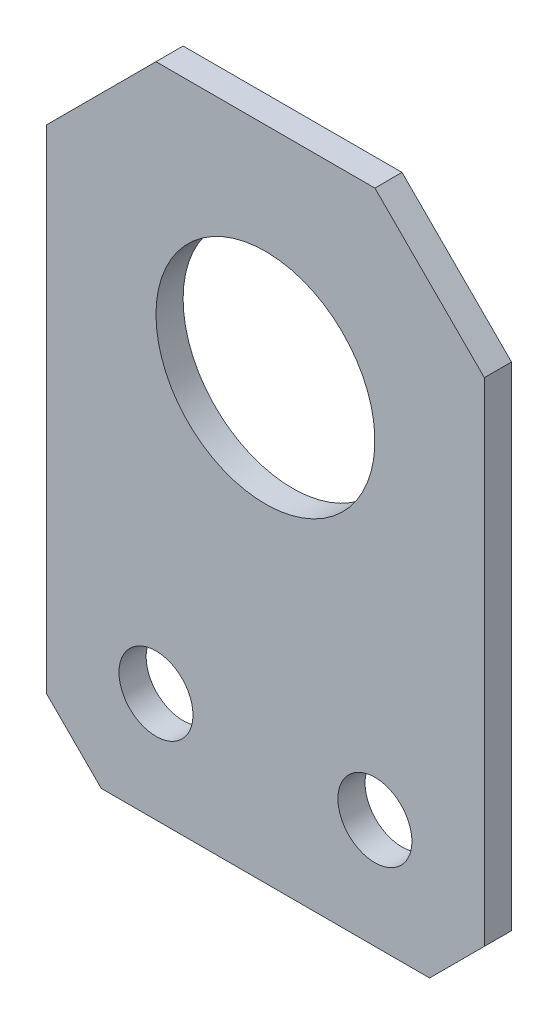
ISO-10303-21;
HEADER;
FILE_DESCRIPTION(('STEP AP214'),'2;1');
FILE_NAME('part.step','',(''),(''),'','','');
FILE_SCHEMA(('AUTOMOTIVE_DESIGN { 1 0 10303 214 1 1 1 1 }'));
ENDSEC;
DATA;
#1=APPLICATION_CONTEXT('core data for automotive mechanical design processes');
#2=APPLICATION_PROTOCOL_DEFINITION('international standard','automotive_design',2000,#1);
#3=PRODUCT_CONTEXT('',#1,'mechanical');
#4=PRODUCT('Part','Part','',(#3));
#5=PRODUCT_RELATED_PRODUCT_CATEGORY('part','',(#4));
#6=PRODUCT_DEFINITION_FORMATION('','',#4);
#7=PRODUCT_DEFINITION_CONTEXT('part definition',#1,'design');
#8=PRODUCT_DEFINITION('design','',#6,#7);
#9=PRODUCT_DEFINITION_SHAPE('','',#8);
#10=(LENGTH_UNIT() NAMED_UNIT(*) SI_UNIT(.MILLI.,.METRE.));
#11=(NAMED_UNIT(*) PLANE_ANGLE_UNIT() SI_UNIT($,.RADIAN.));
#12=(NAMED_UNIT(*) SI_UNIT($,.STERADIAN.) SOLID_ANGLE_UNIT());
#13=UNCERTAINTY_MEASURE_WITH_UNIT(LENGTH_MEASURE(1.E-05),#10,'distance_accuracy_value','');
#14=(GEOMETRIC_REPRESENTATION_CONTEXT(3) GLOBAL_UNCERTAINTY_ASSIGNED_CONTEXT((#13)) GLOBAL_UNIT_ASSIGNED_CONTEXT((#10,
#11,#12)) REPRESENTATION_CONTEXT('',''));
#15=CARTESIAN_POINT('',(0.,0.,0.));
#16=DIRECTION('',(0.,0.,1.));
#17=DIRECTION('',(1.,0.,0.));
#18=AXIS2_PLACEMENT_3D('',#15,#16,#17);
#19=CARTESIAN_POINT('',(-12.7,-25.4,0.));
#20=DIRECTION('',(0.,0.,1.));
#21=DIRECTION('',(1.,0.,0.));
#22=AXIS2_PLACEMENT_3D('',#19,#20,#21);
#23=PLANE('',#22);
#24=CARTESIAN_POINT('',(6.35,-19.05,0.));
#25=DIRECTION('',(0.,0.,-1.));
#26=DIRECTION('',(-1.,0.,0.));
#27=AXIS2_PLACEMENT_3D('',#24,#25,#26);
#28=CIRCLE('',#27,2.1463);
#29=CARTESIAN_POINT('',(4.2037,-19.05,0.));
#30=VERTEX_POINT('',#29);
#31=EDGE_CURVE('E114',#30,#30,#28,.F.);
#32=ORIENTED_EDGE('',*,*,#31,.T.);
#33=EDGE_LOOP('',(#32));
#34=FACE_BOUND('',#33,.T.);
#35=CARTESIAN_POINT('',(0.,0.,0.));
#36=DIRECTION('',(0.,0.,-1.));
#37=DIRECTION('',(-1.,0.,0.));
#38=AXIS2_PLACEMENT_3D('',#35,#36,#37);
#39=CIRCLE('',#38,6.35);
#40=CARTESIAN_POINT('',(-6.35,0.,0.));
#41=VERTEX_POINT('',#40);
#42=EDGE_CURVE('E116',#41,#41,#39,.F.);
#43=ORIENTED_EDGE('',*,*,#42,.T.);
#44=EDGE_LOOP('',(#43));
#45=FACE_BOUND('',#44,.T.);
#46=DIRECTION('',(-0.707106781186549,-0.707106781186546,0.));
#47=VECTOR('',#46,1.);
#48=CARTESIAN_POINT('',(12.7,-22.225,0.));
#49=LINE('',#48,#47);
#50=CARTESIAN_POINT('',(12.7,-22.225,0.));
#51=VERTEX_POINT('',#50);
#52=CARTESIAN_POINT('',(9.52499999999998,-25.4,0.));
#53=VERTEX_POINT('',#52);
#54=EDGE_CURVE('E81',#51,#53,#49,.T.);
#55=ORIENTED_EDGE('',*,*,#54,.T.);
#56=DIRECTION('',(1.,0.,0.));
#57=VECTOR('',#56,1.);
#58=CARTESIAN_POINT('',(-12.7,-25.4,0.));
#59=LINE('',#58,#57);
#60=CARTESIAN_POINT('',(-9.525,-25.4,0.));
#61=VERTEX_POINT('',#60);
#62=EDGE_CURVE('E84',#53,#61,#59,.F.);
#63=ORIENTED_EDGE('',*,*,#62,.T.);
#64=DIRECTION('',(-0.707106781186547,0.707106781186548,0.));
#65=VECTOR('',#64,1.);
#66=CARTESIAN_POINT('',(-9.525,-25.4,0.));
#67=LINE('',#66,#65);
#68=CARTESIAN_POINT('',(-12.7,-22.225,0.));
#69=VERTEX_POINT('',#68);
#70=EDGE_CURVE('E120',#61,#69,#67,.T.);
#71=ORIENTED_EDGE('',*,*,#70,.T.);
#72=DIRECTION('',(0.,1.,0.));
#73=VECTOR('',#72,1.);
#74=CARTESIAN_POINT('',(-12.7,12.7,0.));
#75=LINE('',#74,#73);
#76=CARTESIAN_POINT('',(-12.7,6.35,0.));
#77=VERTEX_POINT('',#76);
#78=EDGE_CURVE('E127',#69,#77,#75,.T.);
#79=ORIENTED_EDGE('',*,*,#78,.T.);
#80=DIRECTION('',(0.707106781186549,0.707106781186546,0.));
#81=VECTOR('',#80,1.);
#82=CARTESIAN_POINT('',(-12.7,6.35,0.));
#83=LINE('',#82,#81);
#84=CARTESIAN_POINT('',(-6.34999999999997,12.7,0.));
#85=VERTEX_POINT('',#84);
#86=EDGE_CURVE('E134',#77,#85,#83,.T.);
#87=ORIENTED_EDGE('',*,*,#86,.T.);
#88=DIRECTION('',(1.,0.,0.));
#89=VECTOR('',#88,1.);
#90=CARTESIAN_POINT('',(-12.7,12.7,0.));
#91=LINE('',#90,#89);
#92=CARTESIAN_POINT('',(6.35,12.7,0.));
#93=VERTEX_POINT('',#92);
#94=EDGE_CURVE('E138',#85,#93,#91,.T.);
#95=ORIENTED_EDGE('',*,*,#94,.T.);
#96=DIRECTION('',(0.707106781186546,-0.707106781186549,0.));
#97=VECTOR('',#96,1.);
#98=CARTESIAN_POINT('',(6.35,12.7,0.));
#99=LINE('',#98,#97);
#100=CARTESIAN_POINT('',(12.7,6.34999999999997,0.));
#101=VERTEX_POINT('',#100);
#102=EDGE_CURVE('E142',#93,#101,#99,.T.);
#103=ORIENTED_EDGE('',*,*,#102,.T.);
#104=DIRECTION('',(0.,-1.,0.));
#105=VECTOR('',#104,1.);
#106=CARTESIAN_POINT('',(12.7,12.7,0.));
#107=LINE('',#106,#105);
#108=EDGE_CURVE('E79',#101,#51,#107,.T.);
#109=ORIENTED_EDGE('',*,*,#108,.T.);
#110=EDGE_LOOP('',(#55,#63,#71,#79,#87,#95,#103,#109));
#111=FACE_BOUND('',#110,.T.);
#112=CARTESIAN_POINT('',(-6.35,-19.05,0.));
#113=DIRECTION('',(0.,0.,-1.));
#114=DIRECTION('',(-1.,0.,0.));
#115=AXIS2_PLACEMENT_3D('',#112,#113,#114);
#116=CIRCLE('',#115,2.1463);
#117=CARTESIAN_POINT('',(-8.4963,-19.05,0.));
#118=VERTEX_POINT('',#117);
#119=EDGE_CURVE('E19',#118,#118,#116,.F.);
#120=ORIENTED_EDGE('',*,*,#119,.T.);
#121=EDGE_LOOP('',(#120));
#122=FACE_BOUND('',#121,.T.);
#123=ADVANCED_FACE('F16',(#34,#45,#111,#122),#23,.F.);
#124=CARTESIAN_POINT('',(-6.35,-19.05,1.5748));
#125=DIRECTION('',(0.,0.,-1.));
#126=DIRECTION('',(-1.,0.,0.));
#127=AXIS2_PLACEMENT_3D('',#124,#125,#126);
#128=CYLINDRICAL_SURFACE('',#127,2.1463);
#129=CARTESIAN_POINT('',(-6.35,-19.05,1.5748));
#130=DIRECTION('',(0.,0.,-1.));
#131=DIRECTION('',(-1.,0.,0.));
#132=AXIS2_PLACEMENT_3D('',#129,#130,#131);
#133=CIRCLE('',#132,2.1463);
#134=CARTESIAN_POINT('',(-8.4963,-19.05,1.5748));
#135=VERTEX_POINT('',#134);
#136=EDGE_CURVE('E110',#135,#135,#133,.T.);
#137=ORIENTED_EDGE('',*,*,#136,.F.);
#138=EDGE_LOOP('',(#137));
#139=FACE_BOUND('',#138,.T.);
#140=ORIENTED_EDGE('',*,*,#119,.F.);
#141=EDGE_LOOP('',(#140));
#142=FACE_BOUND('',#141,.T.);
#143=ADVANCED_FACE('F282',(#139,#142),#128,.F.);
#144=CARTESIAN_POINT('',(-12.7,-25.4,1.5748));
#145=DIRECTION('',(0.,1.,0.));
#146=DIRECTION('',(0.,0.,1.));
#147=AXIS2_PLACEMENT_3D('',#144,#145,#146);
#148=PLANE('',#147);
#149=DIRECTION('',(0.,0.,1.));
#150=VECTOR('',#149,1.);
#151=CARTESIAN_POINT('',(9.52499999999999,-25.4,1.5748));
#152=LINE('',#151,#150);
#153=CARTESIAN_POINT('',(9.52499999999998,-25.4,1.5748));
#154=VERTEX_POINT('',#153);
#155=EDGE_CURVE('E89',#53,#154,#152,.T.);
#156=ORIENTED_EDGE('',*,*,#155,.T.);
#157=DIRECTION('',(1.,0.,0.));
#158=VECTOR('',#157,1.);
#159=CARTESIAN_POINT('',(-12.7,-25.4,1.5748));
#160=LINE('',#159,#158);
#161=CARTESIAN_POINT('',(-9.525,-25.4,1.5748));
#162=VERTEX_POINT('',#161);
#163=EDGE_CURVE('E113',#162,#154,#160,.T.);
#164=ORIENTED_EDGE('',*,*,#163,.F.);
#165=DIRECTION('',(0.,0.,1.));
#166=VECTOR('',#165,1.);
#167=CARTESIAN_POINT('',(-9.525,-25.4,1.5748));
#168=LINE('',#167,#166);
#169=EDGE_CURVE('E95',#162,#61,#168,.F.);
#170=ORIENTED_EDGE('',*,*,#169,.T.);
#171=ORIENTED_EDGE('',*,*,#62,.F.);
#172=EDGE_LOOP('',(#156,#164,#170,#171));
#173=FACE_BOUND('',#172,.T.);
#174=ADVANCED_FACE('F92',(#173),#148,.F.);
#175=CARTESIAN_POINT('',(12.7,-22.225,1.5748));
#176=DIRECTION('',(-0.707106781186546,0.707106781186549,0.));
#177=DIRECTION('',(-0.707106781186549,-0.707106781186546,0.));
#178=AXIS2_PLACEMENT_3D('',#175,#176,#177);
#179=PLANE('',#178);
#180=ORIENTED_EDGE('',*,*,#155,.F.);
#181=ORIENTED_EDGE('',*,*,#54,.F.);
#182=DIRECTION('',(0.,0.,1.));
#183=VECTOR('',#182,1.);
#184=CARTESIAN_POINT('',(12.7,-22.225,1.5748));
#185=LINE('',#184,#183);
#186=CARTESIAN_POINT('',(12.7,-22.225,1.5748));
#187=VERTEX_POINT('',#186);
#188=EDGE_CURVE('E103',#51,#187,#185,.T.);
#189=ORIENTED_EDGE('',*,*,#188,.T.);
#190=DIRECTION('',(0.707106781186549,0.707106781186546,0.));
#191=VECTOR('',#190,1.);
#192=CARTESIAN_POINT('',(9.52499999999998,-25.4,1.5748));
#193=LINE('',#192,#191);
#194=EDGE_CURVE('E100',#154,#187,#193,.T.);
#195=ORIENTED_EDGE('',*,*,#194,.F.);
#196=EDGE_LOOP('',(#180,#181,#189,#195));
#197=FACE_BOUND('',#196,.T.);
#198=ADVANCED_FACE('F98',(#197),#179,.F.);
#199=CARTESIAN_POINT('',(12.7,12.7,1.5748));
#200=DIRECTION('',(-1.,0.,0.));
#201=DIRECTION('',(0.,-1.,0.));
#202=AXIS2_PLACEMENT_3D('',#199,#200,#201);
#203=PLANE('',#202);
#204=ORIENTED_EDGE('',*,*,#188,.F.);
#205=ORIENTED_EDGE('',*,*,#108,.F.);
#206=DIRECTION('',(0.,0.,1.));
#207=VECTOR('',#206,1.);
#208=CARTESIAN_POINT('',(12.7,6.34999999999997,1.5748));
#209=LINE('',#208,#207);
#210=CARTESIAN_POINT('',(12.7,6.34999999999997,1.5748));
#211=VERTEX_POINT('',#210);
#212=EDGE_CURVE('E140',#101,#211,#209,.T.);
#213=ORIENTED_EDGE('',*,*,#212,.T.);
#214=DIRECTION('',(0.,1.,0.));
#215=VECTOR('',#214,1.);
#216=CARTESIAN_POINT('',(12.7,-25.4,1.5748));
#217=LINE('',#216,#215);
#218=EDGE_CURVE('E146',#187,#211,#217,.T.);
#219=ORIENTED_EDGE('',*,*,#218,.F.);
#220=EDGE_LOOP('',(#204,#205,#213,#219));
#221=FACE_BOUND('',#220,.T.);
#222=ADVANCED_FACE('F147',(#221),#203,.F.);
#223=CARTESIAN_POINT('',(6.35,12.7,1.5748));
#224=DIRECTION('',(-0.707106781186549,-0.707106781186546,0.));
#225=DIRECTION('',(0.707106781186546,-0.707106781186549,0.));
#226=AXIS2_PLACEMENT_3D('',#223,#224,#225);
#227=PLANE('',#226);
#228=ORIENTED_EDGE('',*,*,#212,.F.);
#229=ORIENTED_EDGE('',*,*,#102,.F.);
#230=DIRECTION('',(0.,0.,-1.));
#231=VECTOR('',#230,1.);
#232=CARTESIAN_POINT('',(6.35,12.7,1.5748));
#233=LINE('',#232,#231);
#234=CARTESIAN_POINT('',(6.35,12.7,1.5748));
#235=VERTEX_POINT('',#234);
#236=EDGE_CURVE('E136',#93,#235,#233,.F.);
#237=ORIENTED_EDGE('',*,*,#236,.T.);
#238=DIRECTION('',(-0.707106781186546,0.707106781186549,0.));
#239=VECTOR('',#238,1.);
#240=CARTESIAN_POINT('',(12.7,6.34999999999997,1.5748));
#241=LINE('',#240,#239);
#242=EDGE_CURVE('E152',#211,#235,#241,.T.);
#243=ORIENTED_EDGE('',*,*,#242,.F.);
#244=EDGE_LOOP('',(#228,#229,#237,#243));
#245=FACE_BOUND('',#244,.T.);
#246=ADVANCED_FACE('F183',(#245),#227,.F.);
#247=CARTESIAN_POINT('',(-12.7,12.7,1.5748));
#248=DIRECTION('',(0.,-1.,0.));
#249=DIRECTION('',(0.,0.,-1.));
#250=AXIS2_PLACEMENT_3D('',#247,#248,#249);
#251=PLANE('',#250);
#252=ORIENTED_EDGE('',*,*,#236,.F.);
#253=ORIENTED_EDGE('',*,*,#94,.F.);
#254=DIRECTION('',(0.,0.,1.));
#255=VECTOR('',#254,1.);
#256=CARTESIAN_POINT('',(-6.34999999999997,12.7,1.5748));
#257=LINE('',#256,#255);
#258=CARTESIAN_POINT('',(-6.34999999999997,12.7,1.5748));
#259=VERTEX_POINT('',#258);
#260=EDGE_CURVE('E132',#85,#259,#257,.T.);
#261=ORIENTED_EDGE('',*,*,#260,.T.);
#262=DIRECTION('',(1.,0.,0.));
#263=VECTOR('',#262,1.);
#264=CARTESIAN_POINT('',(-12.7,12.7,1.5748));
#265=LINE('',#264,#263);
#266=EDGE_CURVE('E160',#235,#259,#265,.F.);
#267=ORIENTED_EDGE('',*,*,#266,.F.);
#268=EDGE_LOOP('',(#252,#253,#261,#267));
#269=FACE_BOUND('',#268,.T.);
#270=ADVANCED_FACE('F180',(#269),#251,.F.);
#271=CARTESIAN_POINT('',(-12.7,6.35,1.5748));
#272=DIRECTION('',(0.707106781186546,-0.707106781186549,0.));
#273=DIRECTION('',(0.707106781186549,0.707106781186546,0.));
#274=AXIS2_PLACEMENT_3D('',#271,#272,#273);
#275=PLANE('',#274);
#276=ORIENTED_EDGE('',*,*,#260,.F.);
#277=ORIENTED_EDGE('',*,*,#86,.F.);
#278=DIRECTION('',(0.,0.,1.));
#279=VECTOR('',#278,1.);
#280=CARTESIAN_POINT('',(-12.7,6.35,1.5748));
#281=LINE('',#280,#279);
#282=CARTESIAN_POINT('',(-12.7,6.35000000000001,1.5748));
#283=VERTEX_POINT('',#282);
#284=EDGE_CURVE('E130',#77,#283,#281,.T.);
#285=ORIENTED_EDGE('',*,*,#284,.T.);
#286=DIRECTION('',(-0.70710678118655,-0.707106781186545,0.));
#287=VECTOR('',#286,1.);
#288=CARTESIAN_POINT('',(-6.34999999999997,12.7,1.5748));
#289=LINE('',#288,#287);
#290=EDGE_CURVE('E163',#259,#283,#289,.T.);
#291=ORIENTED_EDGE('',*,*,#290,.F.);
#292=EDGE_LOOP('',(#276,#277,#285,#291));
#293=FACE_BOUND('',#292,.T.);
#294=ADVANCED_FACE('F175',(#293),#275,.F.);
#295=CARTESIAN_POINT('',(-12.7,12.7,1.5748));
#296=DIRECTION('',(1.,0.,0.));
#297=DIRECTION('',(0.,1.,0.));
#298=AXIS2_PLACEMENT_3D('',#295,#296,#297);
#299=PLANE('',#298);
#300=DIRECTION('',(0.,0.,1.));
#301=VECTOR('',#300,1.);
#302=CARTESIAN_POINT('',(-12.7,-22.225,1.5748));
#303=LINE('',#302,#301);
#304=CARTESIAN_POINT('',(-12.7,-22.225,1.5748));
#305=VERTEX_POINT('',#304);
#306=EDGE_CURVE('E34',#69,#305,#303,.T.);
#307=ORIENTED_EDGE('',*,*,#306,.T.);
#308=DIRECTION('',(0.,1.,0.));
#309=VECTOR('',#308,1.);
#310=CARTESIAN_POINT('',(-12.7,-25.4,1.5748));
#311=LINE('',#310,#309);
#312=EDGE_CURVE('E166',#283,#305,#311,.F.);
#313=ORIENTED_EDGE('',*,*,#312,.F.);
#314=ORIENTED_EDGE('',*,*,#284,.F.);
#315=ORIENTED_EDGE('',*,*,#78,.F.);
#316=EDGE_LOOP('',(#307,#313,#314,#315));
#317=FACE_BOUND('',#316,.T.);
#318=ADVANCED_FACE('F171',(#317),#299,.F.);
#319=CARTESIAN_POINT('',(-9.525,-25.4,1.5748));
#320=DIRECTION('',(0.707106781186548,0.707106781186547,0.));
#321=DIRECTION('',(-0.707106781186547,0.707106781186548,0.));
#322=AXIS2_PLACEMENT_3D('',#319,#320,#321);
#323=PLANE('',#322);
#324=ORIENTED_EDGE('',*,*,#306,.F.);
#325=ORIENTED_EDGE('',*,*,#70,.F.);
#326=ORIENTED_EDGE('',*,*,#169,.F.);
#327=DIRECTION('',(0.707106781186547,-0.707106781186548,0.));
#328=VECTOR('',#327,1.);
#329=CARTESIAN_POINT('',(-12.7,-22.225,1.5748));
#330=LINE('',#329,#328);
#331=EDGE_CURVE('E109',#305,#162,#330,.T.);
#332=ORIENTED_EDGE('',*,*,#331,.F.);
#333=EDGE_LOOP('',(#324,#325,#326,#332));
#334=FACE_BOUND('',#333,.T.);
#335=ADVANCED_FACE('F169',(#334),#323,.F.);
#336=CARTESIAN_POINT('',(0.,0.,1.5748));
#337=DIRECTION('',(0.,0.,-1.));
#338=DIRECTION('',(-1.,0.,0.));
#339=AXIS2_PLACEMENT_3D('',#336,#337,#338);
#340=CYLINDRICAL_SURFACE('',#339,6.35);
#341=CARTESIAN_POINT('',(0.,0.,1.5748));
#342=DIRECTION('',(0.,0.,-1.));
#343=DIRECTION('',(-1.,0.,0.));
#344=AXIS2_PLACEMENT_3D('',#341,#342,#343);
#345=CIRCLE('',#344,6.35);
#346=CARTESIAN_POINT('',(-6.35,0.,1.5748));
#347=VERTEX_POINT('',#346);
#348=EDGE_CURVE('E25',#347,#347,#345,.T.);
#349=ORIENTED_EDGE('',*,*,#348,.F.);
#350=EDGE_LOOP('',(#349));
#351=FACE_BOUND('',#350,.T.);
#352=ORIENTED_EDGE('',*,*,#42,.F.);
#353=EDGE_LOOP('',(#352));
#354=FACE_BOUND('',#353,.T.);
#355=ADVANCED_FACE('F200',(#351,#354),#340,.F.);
#356=CARTESIAN_POINT('',(6.35,-19.05,1.5748));
#357=DIRECTION('',(0.,0.,-1.));
#358=DIRECTION('',(-1.,0.,0.));
#359=AXIS2_PLACEMENT_3D('',#356,#357,#358);
#360=CYLINDRICAL_SURFACE('',#359,2.1463);
#361=CARTESIAN_POINT('',(6.35,-19.05,1.5748));
#362=DIRECTION('',(0.,0.,-1.));
#363=DIRECTION('',(-1.,0.,0.));
#364=AXIS2_PLACEMENT_3D('',#361,#362,#363);
#365=CIRCLE('',#364,2.1463);
#366=CARTESIAN_POINT('',(4.2037,-19.05,1.5748));
#367=VERTEX_POINT('',#366);
#368=EDGE_CURVE('E11',#367,#367,#365,.T.);
#369=ORIENTED_EDGE('',*,*,#368,.F.);
#370=EDGE_LOOP('',(#369));
#371=FACE_BOUND('',#370,.T.);
#372=ORIENTED_EDGE('',*,*,#31,.F.);
#373=EDGE_LOOP('',(#372));
#374=FACE_BOUND('',#373,.T.);
#375=ADVANCED_FACE('F194',(#371,#374),#360,.F.);
#376=CARTESIAN_POINT('',(-12.7,-25.4,1.5748));
#377=DIRECTION('',(0.,0.,1.));
#378=DIRECTION('',(1.,0.,0.));
#379=AXIS2_PLACEMENT_3D('',#376,#377,#378);
#380=PLANE('',#379);
#381=ORIENTED_EDGE('',*,*,#368,.T.);
#382=EDGE_LOOP('',(#381));
#383=FACE_BOUND('',#382,.T.);
#384=ORIENTED_EDGE('',*,*,#348,.T.);
#385=EDGE_LOOP('',(#384));
#386=FACE_BOUND('',#385,.T.);
#387=ORIENTED_EDGE('',*,*,#312,.T.);
#388=ORIENTED_EDGE('',*,*,#331,.T.);
#389=ORIENTED_EDGE('',*,*,#163,.T.);
#390=ORIENTED_EDGE('',*,*,#194,.T.);
#391=ORIENTED_EDGE('',*,*,#218,.T.);
#392=ORIENTED_EDGE('',*,*,#242,.T.);
#393=ORIENTED_EDGE('',*,*,#266,.T.);
#394=ORIENTED_EDGE('',*,*,#290,.T.);
#395=EDGE_LOOP('',(#387,#388,#389,#390,#391,#392,#393,#394));
#396=FACE_BOUND('',#395,.T.);
#397=ORIENTED_EDGE('',*,*,#136,.T.);
#398=EDGE_LOOP('',(#397));
#399=FACE_BOUND('',#398,.T.);
#400=ADVANCED_FACE('F155',(#383,#386,#396,#399),#380,.T.);
#401=CLOSED_SHELL('',(#123,#143,#174,#198,#222,#246,#270,#294,#318,#335,#355,#375,#400));
#402=MANIFOLD_SOLID_BREP('B1',#401);
#403=ADVANCED_BREP_SHAPE_REPRESENTATION('',(#18,#402),#14);
#404=SHAPE_DEFINITION_REPRESENTATION(#9,#403);
ENDSEC;
END-ISO-10303-21;
